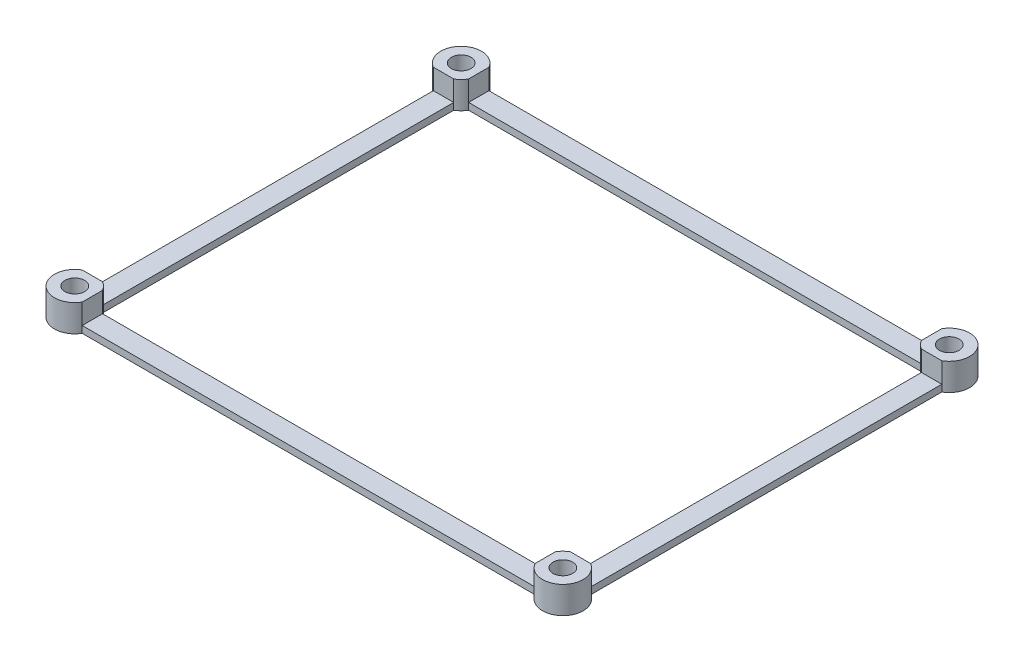
ISO-10303-21;
HEADER;
FILE_DESCRIPTION(('STEP AP214'),'2;1');
FILE_NAME('part.step','',(''),(''),'','','');
FILE_SCHEMA(('AUTOMOTIVE_DESIGN { 1 0 10303 214 1 1 1 1 }'));
ENDSEC;
DATA;
#1=APPLICATION_CONTEXT('core data for automotive mechanical design processes');
#2=APPLICATION_PROTOCOL_DEFINITION('international standard','automotive_design',2000,#1);
#3=PRODUCT_CONTEXT('',#1,'mechanical');
#4=PRODUCT('Part','Part','',(#3));
#5=PRODUCT_RELATED_PRODUCT_CATEGORY('part','',(#4));
#6=PRODUCT_DEFINITION_FORMATION('','',#4);
#7=PRODUCT_DEFINITION_CONTEXT('part definition',#1,'design');
#8=PRODUCT_DEFINITION('design','',#6,#7);
#9=PRODUCT_DEFINITION_SHAPE('','',#8);
#10=(LENGTH_UNIT() NAMED_UNIT(*) SI_UNIT(.MILLI.,.METRE.));
#11=(NAMED_UNIT(*) PLANE_ANGLE_UNIT() SI_UNIT($,.RADIAN.));
#12=(NAMED_UNIT(*) SI_UNIT($,.STERADIAN.) SOLID_ANGLE_UNIT());
#13=UNCERTAINTY_MEASURE_WITH_UNIT(LENGTH_MEASURE(1.E-05),#10,'distance_accuracy_value','');
#14=(GEOMETRIC_REPRESENTATION_CONTEXT(3) GLOBAL_UNCERTAINTY_ASSIGNED_CONTEXT((#13)) GLOBAL_UNIT_ASSIGNED_CONTEXT((#10,
#11,#12)) REPRESENTATION_CONTEXT('',''));
#15=CARTESIAN_POINT('',(0.,0.,0.));
#16=DIRECTION('',(0.,0.,1.));
#17=DIRECTION('',(1.,0.,0.));
#18=AXIS2_PLACEMENT_3D('',#15,#16,#17);
#19=CARTESIAN_POINT('',(36.,4.,-28.5));
#20=DIRECTION('',(0.,1.,0.));
#21=DIRECTION('',(0.,0.,1.));
#22=AXIS2_PLACEMENT_3D('',#19,#20,#21);
#23=PLANE('',#22);
#24=DIRECTION('',(-1.,0.,0.));
#25=VECTOR('',#24,1.);
#26=CARTESIAN_POINT('',(-37.5,4.,-25.9019237886467));
#27=LINE('',#26,#25);
#28=CARTESIAN_POINT('',(-34.5,4.,-25.9019237886467));
#29=VERTEX_POINT('',#28);
#30=CARTESIAN_POINT('',(-37.5,4.,-25.9019237886467));
#31=VERTEX_POINT('',#30);
#32=EDGE_CURVE('E220',#29,#31,#27,.T.);
#33=ORIENTED_EDGE('',*,*,#32,.F.);
#34=CARTESIAN_POINT('',(-36.,4.,-28.5));
#35=DIRECTION('',(0.,-1.,0.));
#36=DIRECTION('',(0.,0.,1.));
#37=AXIS2_PLACEMENT_3D('',#34,#35,#36);
#38=CIRCLE('',#37,3.);
#39=CARTESIAN_POINT('',(-33.4019237886467,4.,-27.));
#40=VERTEX_POINT('',#39);
#41=EDGE_CURVE('E319',#40,#29,#38,.T.);
#42=ORIENTED_EDGE('',*,*,#41,.F.);
#43=DIRECTION('',(0.,0.,1.));
#44=VECTOR('',#43,1.);
#45=CARTESIAN_POINT('',(-33.4019237886467,4.,-27.));
#46=LINE('',#45,#44);
#47=CARTESIAN_POINT('',(-33.4019237886467,4.,-30.));
#48=VERTEX_POINT('',#47);
#49=EDGE_CURVE('E318',#48,#40,#46,.T.);
#50=ORIENTED_EDGE('',*,*,#49,.F.);
#51=CARTESIAN_POINT('',(-36.,4.,-28.5));
#52=DIRECTION('',(0.,1.,0.));
#53=DIRECTION('',(0.,0.,1.));
#54=AXIS2_PLACEMENT_3D('',#51,#52,#53);
#55=CIRCLE('',#54,3.);
#56=EDGE_CURVE('E229',#48,#31,#55,.T.);
#57=ORIENTED_EDGE('',*,*,#56,.T.);
#58=EDGE_LOOP('',(#33,#42,#50,#57));
#59=FACE_BOUND('',#58,.T.);
#60=CARTESIAN_POINT('',(-36.,4.,-28.5));
#61=DIRECTION('',(0.,1.,0.));
#62=DIRECTION('',(0.,0.,1.));
#63=AXIS2_PLACEMENT_3D('',#60,#61,#62);
#64=CIRCLE('',#63,1.45);
#65=CARTESIAN_POINT('',(-36.,4.,-27.05));
#66=VERTEX_POINT('',#65);
#67=EDGE_CURVE('E391',#66,#66,#64,.T.);
#68=ORIENTED_EDGE('',*,*,#67,.F.);
#69=EDGE_LOOP('',(#68));
#70=FACE_BOUND('',#69,.T.);
#71=ADVANCED_FACE('F35',(#59,#70),#23,.T.);
#72=DIRECTION('',(1.,0.,0.));
#73=VECTOR('',#72,1.);
#74=CARTESIAN_POINT('',(-37.5,4.,25.9019237886467));
#75=LINE('',#74,#73);
#76=CARTESIAN_POINT('',(-37.5,4.,25.9019237886467));
#77=VERTEX_POINT('',#76);
#78=CARTESIAN_POINT('',(-34.5,4.,25.9019237886467));
#79=VERTEX_POINT('',#78);
#80=EDGE_CURVE('E200',#77,#79,#75,.T.);
#81=ORIENTED_EDGE('',*,*,#80,.F.);
#82=CARTESIAN_POINT('',(-36.,4.,28.5));
#83=DIRECTION('',(0.,1.,0.));
#84=DIRECTION('',(0.,0.,1.));
#85=AXIS2_PLACEMENT_3D('',#82,#83,#84);
#86=CIRCLE('',#85,3.00000000000001);
#87=CARTESIAN_POINT('',(-33.4019237886467,4.,30.));
#88=VERTEX_POINT('',#87);
#89=EDGE_CURVE('E216',#77,#88,#86,.T.);
#90=ORIENTED_EDGE('',*,*,#89,.T.);
#91=DIRECTION('',(0.,0.,1.));
#92=VECTOR('',#91,1.);
#93=CARTESIAN_POINT('',(-33.4019237886467,4.,27.));
#94=LINE('',#93,#92);
#95=CARTESIAN_POINT('',(-33.4019237886467,4.,27.));
#96=VERTEX_POINT('',#95);
#97=EDGE_CURVE('E434',#96,#88,#94,.T.);
#98=ORIENTED_EDGE('',*,*,#97,.F.);
#99=CARTESIAN_POINT('',(-36.,4.,28.5));
#100=DIRECTION('',(0.,-1.,0.));
#101=DIRECTION('',(0.,0.,1.));
#102=AXIS2_PLACEMENT_3D('',#99,#100,#101);
#103=CIRCLE('',#102,3.00000000000001);
#104=EDGE_CURVE('E219',#79,#96,#103,.T.);
#105=ORIENTED_EDGE('',*,*,#104,.F.);
#106=EDGE_LOOP('',(#81,#90,#98,#105));
#107=FACE_BOUND('',#106,.T.);
#108=CARTESIAN_POINT('',(-36.,4.,28.5));
#109=DIRECTION('',(0.,1.,0.));
#110=DIRECTION('',(0.,0.,1.));
#111=AXIS2_PLACEMENT_3D('',#108,#109,#110);
#112=CIRCLE('',#111,1.45);
#113=CARTESIAN_POINT('',(-36.,4.,29.95));
#114=VERTEX_POINT('',#113);
#115=EDGE_CURVE('E397',#114,#114,#112,.T.);
#116=ORIENTED_EDGE('',*,*,#115,.F.);
#117=EDGE_LOOP('',(#116));
#118=FACE_BOUND('',#117,.T.);
#119=ADVANCED_FACE('F213',(#107,#118),#23,.T.);
#120=DIRECTION('',(-1.,0.,0.));
#121=VECTOR('',#120,1.);
#122=CARTESIAN_POINT('',(34.5,4.,-25.9019237886467));
#123=LINE('',#122,#121);
#124=CARTESIAN_POINT('',(37.5,4.,-25.9019237886467));
#125=VERTEX_POINT('',#124);
#126=CARTESIAN_POINT('',(34.5,4.,-25.9019237886467));
#127=VERTEX_POINT('',#126);
#128=EDGE_CURVE('E421',#125,#127,#123,.T.);
#129=ORIENTED_EDGE('',*,*,#128,.F.);
#130=CARTESIAN_POINT('',(36.,4.,-28.5));
#131=DIRECTION('',(0.,1.,0.));
#132=DIRECTION('',(0.,0.,1.));
#133=AXIS2_PLACEMENT_3D('',#130,#131,#132);
#134=CIRCLE('',#133,3.);
#135=CARTESIAN_POINT('',(33.4019237886467,4.,-30.));
#136=VERTEX_POINT('',#135);
#137=EDGE_CURVE('E235',#125,#136,#134,.T.);
#138=ORIENTED_EDGE('',*,*,#137,.T.);
#139=DIRECTION('',(0.,0.,-1.));
#140=VECTOR('',#139,1.);
#141=CARTESIAN_POINT('',(33.4019237886467,4.,-27.));
#142=LINE('',#141,#140);
#143=CARTESIAN_POINT('',(33.4019237886467,4.,-27.));
#144=VERTEX_POINT('',#143);
#145=EDGE_CURVE('E321',#144,#136,#142,.T.);
#146=ORIENTED_EDGE('',*,*,#145,.F.);
#147=CARTESIAN_POINT('',(36.,4.,-28.5));
#148=DIRECTION('',(0.,-1.,0.));
#149=DIRECTION('',(0.,0.,1.));
#150=AXIS2_PLACEMENT_3D('',#147,#148,#149);
#151=CIRCLE('',#150,3.);
#152=EDGE_CURVE('E338',#127,#144,#151,.T.);
#153=ORIENTED_EDGE('',*,*,#152,.F.);
#154=EDGE_LOOP('',(#129,#138,#146,#153));
#155=FACE_BOUND('',#154,.T.);
#156=CARTESIAN_POINT('',(36.,4.,-28.5));
#157=DIRECTION('',(0.,1.,0.));
#158=DIRECTION('',(0.,0.,1.));
#159=AXIS2_PLACEMENT_3D('',#156,#157,#158);
#160=CIRCLE('',#159,1.45);
#161=CARTESIAN_POINT('',(36.,4.,-27.05));
#162=VERTEX_POINT('',#161);
#163=EDGE_CURVE('E243',#162,#162,#160,.T.);
#164=ORIENTED_EDGE('',*,*,#163,.F.);
#165=EDGE_LOOP('',(#164));
#166=FACE_BOUND('',#165,.T.);
#167=ADVANCED_FACE('F418',(#155,#166),#23,.T.);
#168=CARTESIAN_POINT('',(-33.4019237886467,4.,-30.));
#169=DIRECTION('',(0.,0.,1.));
#170=DIRECTION('',(1.,0.,0.));
#171=AXIS2_PLACEMENT_3D('',#168,#169,#170);
#172=PLANE('',#171);
#173=DIRECTION('',(1.,0.,0.));
#174=VECTOR('',#173,1.);
#175=CARTESIAN_POINT('',(33.4019237886467,1.,-30.));
#176=LINE('',#175,#174);
#177=CARTESIAN_POINT('',(-33.4019237886467,1.,-30.));
#178=VERTEX_POINT('',#177);
#179=CARTESIAN_POINT('',(33.4019237886467,1.,-30.));
#180=VERTEX_POINT('',#179);
#181=EDGE_CURVE('E328',#178,#180,#176,.T.);
#182=ORIENTED_EDGE('',*,*,#181,.T.);
#183=DIRECTION('',(0.,-1.,0.));
#184=VECTOR('',#183,1.);
#185=CARTESIAN_POINT('',(33.4019237886467,4.,-30.));
#186=LINE('',#185,#184);
#187=CARTESIAN_POINT('',(33.4019237886467,0.,-30.));
#188=VERTEX_POINT('',#187);
#189=EDGE_CURVE('E43',#180,#188,#186,.T.);
#190=ORIENTED_EDGE('',*,*,#189,.T.);
#191=DIRECTION('',(-1.,0.,0.));
#192=VECTOR('',#191,1.);
#193=CARTESIAN_POINT('',(-33.4019237886467,0.,-30.));
#194=LINE('',#193,#192);
#195=CARTESIAN_POINT('',(-33.4019237886467,0.,-30.));
#196=VERTEX_POINT('',#195);
#197=EDGE_CURVE('E242',#188,#196,#194,.T.);
#198=ORIENTED_EDGE('',*,*,#197,.T.);
#199=DIRECTION('',(0.,-1.,0.));
#200=VECTOR('',#199,1.);
#201=CARTESIAN_POINT('',(-33.4019237886467,4.,-30.));
#202=LINE('',#201,#200);
#203=EDGE_CURVE('E277',#178,#196,#202,.T.);
#204=ORIENTED_EDGE('',*,*,#203,.F.);
#205=EDGE_LOOP('',(#182,#190,#198,#204));
#206=FACE_BOUND('',#205,.T.);
#207=ADVANCED_FACE('F290',(#206),#172,.F.);
#208=CARTESIAN_POINT('',(-37.5,4.,25.9019237886467));
#209=DIRECTION('',(1.,0.,0.));
#210=DIRECTION('',(0.,0.,-1.));
#211=AXIS2_PLACEMENT_3D('',#208,#209,#210);
#212=PLANE('',#211);
#213=DIRECTION('',(0.,0.,-1.));
#214=VECTOR('',#213,1.);
#215=CARTESIAN_POINT('',(-37.5,1.,-25.9019237886467));
#216=LINE('',#215,#214);
#217=CARTESIAN_POINT('',(-37.5,1.,25.9019237886467));
#218=VERTEX_POINT('',#217);
#219=CARTESIAN_POINT('',(-37.5,1.,-25.9019237886467));
#220=VERTEX_POINT('',#219);
#221=EDGE_CURVE('E302',#218,#220,#216,.T.);
#222=ORIENTED_EDGE('',*,*,#221,.T.);
#223=DIRECTION('',(0.,-1.,0.));
#224=VECTOR('',#223,1.);
#225=CARTESIAN_POINT('',(-37.5,4.,-25.9019237886467));
#226=LINE('',#225,#224);
#227=CARTESIAN_POINT('',(-37.5,0.,-25.9019237886467));
#228=VERTEX_POINT('',#227);
#229=EDGE_CURVE('E207',#220,#228,#226,.T.);
#230=ORIENTED_EDGE('',*,*,#229,.T.);
#231=DIRECTION('',(0.,0.,1.));
#232=VECTOR('',#231,1.);
#233=CARTESIAN_POINT('',(-37.5,0.,25.9019237886467));
#234=LINE('',#233,#232);
#235=CARTESIAN_POINT('',(-37.5,0.,25.9019237886467));
#236=VERTEX_POINT('',#235);
#237=EDGE_CURVE('E249',#228,#236,#234,.T.);
#238=ORIENTED_EDGE('',*,*,#237,.T.);
#239=DIRECTION('',(0.,-1.,0.));
#240=VECTOR('',#239,1.);
#241=CARTESIAN_POINT('',(-37.5,4.,25.9019237886467));
#242=LINE('',#241,#240);
#243=EDGE_CURVE('E208',#218,#236,#242,.T.);
#244=ORIENTED_EDGE('',*,*,#243,.F.);
#245=EDGE_LOOP('',(#222,#230,#238,#244));
#246=FACE_BOUND('',#245,.T.);
#247=ADVANCED_FACE('F301',(#246),#212,.F.);
#248=CARTESIAN_POINT('',(-33.4019237886467,4.,30.));
#249=DIRECTION('',(0.,0.,-1.));
#250=DIRECTION('',(-1.,0.,0.));
#251=AXIS2_PLACEMENT_3D('',#248,#249,#250);
#252=PLANE('',#251);
#253=DIRECTION('',(-1.,0.,0.));
#254=VECTOR('',#253,1.);
#255=CARTESIAN_POINT('',(-33.4019237886467,1.,30.));
#256=LINE('',#255,#254);
#257=CARTESIAN_POINT('',(33.4019237886467,1.,30.));
#258=VERTEX_POINT('',#257);
#259=CARTESIAN_POINT('',(-33.4019237886467,1.,30.));
#260=VERTEX_POINT('',#259);
#261=EDGE_CURVE('E221',#258,#260,#256,.T.);
#262=ORIENTED_EDGE('',*,*,#261,.T.);
#263=DIRECTION('',(0.,-1.,0.));
#264=VECTOR('',#263,1.);
#265=CARTESIAN_POINT('',(-33.4019237886467,4.,30.));
#266=LINE('',#265,#264);
#267=CARTESIAN_POINT('',(-33.4019237886467,0.,30.));
#268=VERTEX_POINT('',#267);
#269=EDGE_CURVE('E273',#260,#268,#266,.T.);
#270=ORIENTED_EDGE('',*,*,#269,.T.);
#271=DIRECTION('',(1.,0.,0.));
#272=VECTOR('',#271,1.);
#273=CARTESIAN_POINT('',(-33.4019237886467,0.,30.));
#274=LINE('',#273,#272);
#275=CARTESIAN_POINT('',(33.4019237886467,0.,30.));
#276=VERTEX_POINT('',#275);
#277=EDGE_CURVE('E254',#268,#276,#274,.T.);
#278=ORIENTED_EDGE('',*,*,#277,.T.);
#279=DIRECTION('',(0.,-1.,0.));
#280=VECTOR('',#279,1.);
#281=CARTESIAN_POINT('',(33.4019237886467,4.,30.));
#282=LINE('',#281,#280);
#283=EDGE_CURVE('E269',#258,#276,#282,.T.);
#284=ORIENTED_EDGE('',*,*,#283,.F.);
#285=EDGE_LOOP('',(#262,#270,#278,#284));
#286=FACE_BOUND('',#285,.T.);
#287=ADVANCED_FACE('F514',(#286),#252,.F.);
#288=CARTESIAN_POINT('',(37.5,4.,25.9019237886467));
#289=DIRECTION('',(-1.,0.,0.));
#290=DIRECTION('',(0.,0.,1.));
#291=AXIS2_PLACEMENT_3D('',#288,#289,#290);
#292=PLANE('',#291);
#293=DIRECTION('',(0.,0.,1.));
#294=VECTOR('',#293,1.);
#295=CARTESIAN_POINT('',(37.5,1.,25.9019237886467));
#296=LINE('',#295,#294);
#297=CARTESIAN_POINT('',(37.5,1.,-25.9019237886467));
#298=VERTEX_POINT('',#297);
#299=CARTESIAN_POINT('',(37.5,1.,25.9019237886467));
#300=VERTEX_POINT('',#299);
#301=EDGE_CURVE('E437',#298,#300,#296,.T.);
#302=ORIENTED_EDGE('',*,*,#301,.T.);
#303=DIRECTION('',(0.,-1.,0.));
#304=VECTOR('',#303,1.);
#305=CARTESIAN_POINT('',(37.5,4.,25.9019237886467));
#306=LINE('',#305,#304);
#307=CARTESIAN_POINT('',(37.5,0.,25.9019237886467));
#308=VERTEX_POINT('',#307);
#309=EDGE_CURVE('E266',#300,#308,#306,.T.);
#310=ORIENTED_EDGE('',*,*,#309,.T.);
#311=DIRECTION('',(0.,0.,-1.));
#312=VECTOR('',#311,1.);
#313=CARTESIAN_POINT('',(37.5,0.,25.9019237886467));
#314=LINE('',#313,#312);
#315=CARTESIAN_POINT('',(37.5,0.,-25.9019237886467));
#316=VERTEX_POINT('',#315);
#317=EDGE_CURVE('E260',#308,#316,#314,.T.);
#318=ORIENTED_EDGE('',*,*,#317,.T.);
#319=DIRECTION('',(0.,-1.,0.));
#320=VECTOR('',#319,1.);
#321=CARTESIAN_POINT('',(37.5,4.,-25.9019237886467));
#322=LINE('',#321,#320);
#323=EDGE_CURVE('E232',#298,#316,#322,.T.);
#324=ORIENTED_EDGE('',*,*,#323,.F.);
#325=EDGE_LOOP('',(#302,#310,#318,#324));
#326=FACE_BOUND('',#325,.T.);
#327=ADVANCED_FACE('F524',(#326),#292,.F.);
#328=CARTESIAN_POINT('',(-34.5,4.,25.9019237886467));
#329=DIRECTION('',(1.,0.,0.));
#330=DIRECTION('',(0.,0.,-1.));
#331=AXIS2_PLACEMENT_3D('',#328,#329,#330);
#332=PLANE('',#331);
#333=DIRECTION('',(0.,-1.,0.));
#334=VECTOR('',#333,1.);
#335=CARTESIAN_POINT('',(-34.5,4.,-25.9019237886467));
#336=LINE('',#335,#334);
#337=CARTESIAN_POINT('',(-34.5,1.,-25.9019237886467));
#338=VERTEX_POINT('',#337);
#339=CARTESIAN_POINT('',(-34.5,0.,-25.9019237886467));
#340=VERTEX_POINT('',#339);
#341=EDGE_CURVE('E388',#338,#340,#336,.T.);
#342=ORIENTED_EDGE('',*,*,#341,.F.);
#343=DIRECTION('',(0.,0.,1.));
#344=VECTOR('',#343,1.);
#345=CARTESIAN_POINT('',(-34.5,1.,-25.9019237886467));
#346=LINE('',#345,#344);
#347=CARTESIAN_POINT('',(-34.5,1.,25.9019237886467));
#348=VERTEX_POINT('',#347);
#349=EDGE_CURVE('E314',#338,#348,#346,.T.);
#350=ORIENTED_EDGE('',*,*,#349,.T.);
#351=DIRECTION('',(0.,-1.,0.));
#352=VECTOR('',#351,1.);
#353=CARTESIAN_POINT('',(-34.5,4.,25.9019237886467));
#354=LINE('',#353,#352);
#355=CARTESIAN_POINT('',(-34.5,0.,25.9019237886467));
#356=VERTEX_POINT('',#355);
#357=EDGE_CURVE('E385',#348,#356,#354,.T.);
#358=ORIENTED_EDGE('',*,*,#357,.T.);
#359=DIRECTION('',(0.,0.,1.));
#360=VECTOR('',#359,1.);
#361=CARTESIAN_POINT('',(-34.5,0.,25.9019237886467));
#362=LINE('',#361,#360);
#363=EDGE_CURVE('E344',#340,#356,#362,.T.);
#364=ORIENTED_EDGE('',*,*,#363,.F.);
#365=EDGE_LOOP('',(#342,#350,#358,#364));
#366=FACE_BOUND('',#365,.T.);
#367=ADVANCED_FACE('F464',(#366),#332,.T.);
#368=CARTESIAN_POINT('',(-33.4019237886467,4.,27.));
#369=DIRECTION('',(0.,0.,-1.));
#370=DIRECTION('',(-1.,0.,0.));
#371=AXIS2_PLACEMENT_3D('',#368,#369,#370);
#372=PLANE('',#371);
#373=DIRECTION('',(0.,-1.,0.));
#374=VECTOR('',#373,1.);
#375=CARTESIAN_POINT('',(-33.4019237886467,4.,27.));
#376=LINE('',#375,#374);
#377=CARTESIAN_POINT('',(-33.4019237886467,1.,27.));
#378=VERTEX_POINT('',#377);
#379=CARTESIAN_POINT('',(-33.4019237886467,0.,27.));
#380=VERTEX_POINT('',#379);
#381=EDGE_CURVE('E381',#378,#380,#376,.T.);
#382=ORIENTED_EDGE('',*,*,#381,.F.);
#383=DIRECTION('',(1.,0.,0.));
#384=VECTOR('',#383,1.);
#385=CARTESIAN_POINT('',(-33.4019237886467,1.,27.));
#386=LINE('',#385,#384);
#387=CARTESIAN_POINT('',(33.4019237886467,1.,27.));
#388=VERTEX_POINT('',#387);
#389=EDGE_CURVE('E453',#378,#388,#386,.T.);
#390=ORIENTED_EDGE('',*,*,#389,.T.);
#391=DIRECTION('',(0.,-1.,0.));
#392=VECTOR('',#391,1.);
#393=CARTESIAN_POINT('',(33.4019237886467,4.,27.));
#394=LINE('',#393,#392);
#395=CARTESIAN_POINT('',(33.4019237886467,0.,27.));
#396=VERTEX_POINT('',#395);
#397=EDGE_CURVE('E377',#388,#396,#394,.T.);
#398=ORIENTED_EDGE('',*,*,#397,.T.);
#399=DIRECTION('',(1.,0.,0.));
#400=VECTOR('',#399,1.);
#401=CARTESIAN_POINT('',(-33.4019237886467,0.,27.));
#402=LINE('',#401,#400);
#403=EDGE_CURVE('E350',#380,#396,#402,.T.);
#404=ORIENTED_EDGE('',*,*,#403,.F.);
#405=EDGE_LOOP('',(#382,#390,#398,#404));
#406=FACE_BOUND('',#405,.T.);
#407=ADVANCED_FACE('F535',(#406),#372,.T.);
#408=CARTESIAN_POINT('',(34.5,4.,25.9019237886467));
#409=DIRECTION('',(-1.,0.,0.));
#410=DIRECTION('',(0.,0.,1.));
#411=AXIS2_PLACEMENT_3D('',#408,#409,#410);
#412=PLANE('',#411);
#413=DIRECTION('',(0.,-1.,0.));
#414=VECTOR('',#413,1.);
#415=CARTESIAN_POINT('',(34.5,4.,25.9019237886467));
#416=LINE('',#415,#414);
#417=CARTESIAN_POINT('',(34.5,1.,25.9019237886467));
#418=VERTEX_POINT('',#417);
#419=CARTESIAN_POINT('',(34.5,0.,25.9019237886467));
#420=VERTEX_POINT('',#419);
#421=EDGE_CURVE('E373',#418,#420,#416,.T.);
#422=ORIENTED_EDGE('',*,*,#421,.F.);
#423=DIRECTION('',(0.,0.,-1.));
#424=VECTOR('',#423,1.);
#425=CARTESIAN_POINT('',(34.5,1.,25.9019237886467));
#426=LINE('',#425,#424);
#427=CARTESIAN_POINT('',(34.5,1.,-25.9019237886467));
#428=VERTEX_POINT('',#427);
#429=EDGE_CURVE('E435',#418,#428,#426,.T.);
#430=ORIENTED_EDGE('',*,*,#429,.T.);
#431=DIRECTION('',(0.,-1.,0.));
#432=VECTOR('',#431,1.);
#433=CARTESIAN_POINT('',(34.5,4.,-25.9019237886467));
#434=LINE('',#433,#432);
#435=CARTESIAN_POINT('',(34.5,0.,-25.9019237886467));
#436=VERTEX_POINT('',#435);
#437=EDGE_CURVE('E369',#428,#436,#434,.T.);
#438=ORIENTED_EDGE('',*,*,#437,.T.);
#439=DIRECTION('',(0.,0.,-1.));
#440=VECTOR('',#439,1.);
#441=CARTESIAN_POINT('',(34.5,0.,25.9019237886467));
#442=LINE('',#441,#440);
#443=EDGE_CURVE('E356',#420,#436,#442,.T.);
#444=ORIENTED_EDGE('',*,*,#443,.F.);
#445=EDGE_LOOP('',(#422,#430,#438,#444));
#446=FACE_BOUND('',#445,.T.);
#447=ADVANCED_FACE('F503',(#446),#412,.T.);
#448=CARTESIAN_POINT('',(-33.4019237886467,4.,-27.));
#449=DIRECTION('',(0.,0.,1.));
#450=DIRECTION('',(1.,0.,0.));
#451=AXIS2_PLACEMENT_3D('',#448,#449,#450);
#452=PLANE('',#451);
#453=DIRECTION('',(0.,-1.,0.));
#454=VECTOR('',#453,1.);
#455=CARTESIAN_POINT('',(33.4019237886467,4.,-27.));
#456=LINE('',#455,#454);
#457=CARTESIAN_POINT('',(33.4019237886467,1.,-27.));
#458=VERTEX_POINT('',#457);
#459=CARTESIAN_POINT('',(33.4019237886467,0.,-27.));
#460=VERTEX_POINT('',#459);
#461=EDGE_CURVE('E365',#458,#460,#456,.T.);
#462=ORIENTED_EDGE('',*,*,#461,.F.);
#463=DIRECTION('',(-1.,0.,0.));
#464=VECTOR('',#463,1.);
#465=CARTESIAN_POINT('',(33.4019237886467,1.,-27.));
#466=LINE('',#465,#464);
#467=CARTESIAN_POINT('',(-33.4019237886467,1.,-27.));
#468=VERTEX_POINT('',#467);
#469=EDGE_CURVE('E323',#458,#468,#466,.T.);
#470=ORIENTED_EDGE('',*,*,#469,.T.);
#471=DIRECTION('',(0.,-1.,0.));
#472=VECTOR('',#471,1.);
#473=CARTESIAN_POINT('',(-33.4019237886467,4.,-27.));
#474=LINE('',#473,#472);
#475=CARTESIAN_POINT('',(-33.4019237886467,0.,-27.));
#476=VERTEX_POINT('',#475);
#477=EDGE_CURVE('E58',#468,#476,#474,.T.);
#478=ORIENTED_EDGE('',*,*,#477,.T.);
#479=DIRECTION('',(-1.,0.,0.));
#480=VECTOR('',#479,1.);
#481=CARTESIAN_POINT('',(-33.4019237886467,0.,-27.));
#482=LINE('',#481,#480);
#483=EDGE_CURVE('E333',#460,#476,#482,.T.);
#484=ORIENTED_EDGE('',*,*,#483,.F.);
#485=EDGE_LOOP('',(#462,#470,#478,#484));
#486=FACE_BOUND('',#485,.T.);
#487=ADVANCED_FACE('F496',(#486),#452,.T.);
#488=DIRECTION('',(0.,0.,-1.));
#489=VECTOR('',#488,1.);
#490=CARTESIAN_POINT('',(33.4019237886467,4.,27.));
#491=LINE('',#490,#489);
#492=CARTESIAN_POINT('',(33.4019237886467,4.,30.));
#493=VERTEX_POINT('',#492);
#494=CARTESIAN_POINT('',(33.4019237886467,4.,27.));
#495=VERTEX_POINT('',#494);
#496=EDGE_CURVE('E448',#493,#495,#491,.T.);
#497=ORIENTED_EDGE('',*,*,#496,.F.);
#498=CARTESIAN_POINT('',(36.,4.,28.5));
#499=DIRECTION('',(0.,1.,0.));
#500=DIRECTION('',(0.,0.,1.));
#501=AXIS2_PLACEMENT_3D('',#498,#499,#500);
#502=CIRCLE('',#501,3.);
#503=CARTESIAN_POINT('',(37.5,4.,25.9019237886467));
#504=VERTEX_POINT('',#503);
#505=EDGE_CURVE('E228',#493,#504,#502,.T.);
#506=ORIENTED_EDGE('',*,*,#505,.T.);
#507=DIRECTION('',(1.,0.,0.));
#508=VECTOR('',#507,1.);
#509=CARTESIAN_POINT('',(34.5,4.,25.9019237886467));
#510=LINE('',#509,#508);
#511=CARTESIAN_POINT('',(34.5,4.,25.9019237886467));
#512=VERTEX_POINT('',#511);
#513=EDGE_CURVE('E330',#512,#504,#510,.T.);
#514=ORIENTED_EDGE('',*,*,#513,.F.);
#515=CARTESIAN_POINT('',(36.,4.,28.5));
#516=DIRECTION('',(0.,-1.,0.));
#517=DIRECTION('',(0.,0.,1.));
#518=AXIS2_PLACEMENT_3D('',#515,#516,#517);
#519=CIRCLE('',#518,3.);
#520=EDGE_CURVE('E335',#495,#512,#519,.T.);
#521=ORIENTED_EDGE('',*,*,#520,.F.);
#522=EDGE_LOOP('',(#497,#506,#514,#521));
#523=FACE_BOUND('',#522,.T.);
#524=CARTESIAN_POINT('',(36.,4.,28.5));
#525=DIRECTION('',(0.,1.,0.));
#526=DIRECTION('',(0.,0.,1.));
#527=AXIS2_PLACEMENT_3D('',#524,#525,#526);
#528=CIRCLE('',#527,1.45);
#529=CARTESIAN_POINT('',(36.,4.,29.95));
#530=VERTEX_POINT('',#529);
#531=EDGE_CURVE('E403',#530,#530,#528,.T.);
#532=ORIENTED_EDGE('',*,*,#531,.F.);
#533=EDGE_LOOP('',(#532));
#534=FACE_BOUND('',#533,.T.);
#535=ADVANCED_FACE('F489',(#523,#534),#23,.T.);
#536=CARTESIAN_POINT('',(36.,0.,-28.5));
#537=DIRECTION('',(0.,1.,0.));
#538=DIRECTION('',(0.,0.,1.));
#539=AXIS2_PLACEMENT_3D('',#536,#537,#538);
#540=PLANE('',#539);
#541=CARTESIAN_POINT('',(-36.,0.,-28.5));
#542=DIRECTION('',(0.,1.,0.));
#543=DIRECTION('',(0.,0.,1.));
#544=AXIS2_PLACEMENT_3D('',#541,#542,#543);
#545=CIRCLE('',#544,1.45);
#546=CARTESIAN_POINT('',(-36.,0.,-27.05));
#547=VERTEX_POINT('',#546);
#548=EDGE_CURVE('E390',#547,#547,#545,.T.);
#549=ORIENTED_EDGE('',*,*,#548,.T.);
#550=EDGE_LOOP('',(#549));
#551=FACE_BOUND('',#550,.T.);
#552=CARTESIAN_POINT('',(-36.,0.,28.5));
#553=DIRECTION('',(0.,1.,0.));
#554=DIRECTION('',(0.,0.,1.));
#555=AXIS2_PLACEMENT_3D('',#552,#553,#554);
#556=CIRCLE('',#555,1.45);
#557=CARTESIAN_POINT('',(-36.,0.,29.95));
#558=VERTEX_POINT('',#557);
#559=EDGE_CURVE('E394',#558,#558,#556,.T.);
#560=ORIENTED_EDGE('',*,*,#559,.T.);
#561=EDGE_LOOP('',(#560));
#562=FACE_BOUND('',#561,.T.);
#563=CARTESIAN_POINT('',(36.,0.,28.5));
#564=DIRECTION('',(0.,1.,0.));
#565=DIRECTION('',(0.,0.,1.));
#566=AXIS2_PLACEMENT_3D('',#563,#564,#565);
#567=CIRCLE('',#566,1.45);
#568=CARTESIAN_POINT('',(36.,0.,29.95));
#569=VERTEX_POINT('',#568);
#570=EDGE_CURVE('E400',#569,#569,#567,.T.);
#571=ORIENTED_EDGE('',*,*,#570,.T.);
#572=EDGE_LOOP('',(#571));
#573=FACE_BOUND('',#572,.T.);
#574=CARTESIAN_POINT('',(36.,0.,-28.5));
#575=DIRECTION('',(0.,1.,0.));
#576=DIRECTION('',(0.,0.,1.));
#577=AXIS2_PLACEMENT_3D('',#574,#575,#576);
#578=CIRCLE('',#577,1.45);
#579=CARTESIAN_POINT('',(36.,0.,-27.05));
#580=VERTEX_POINT('',#579);
#581=EDGE_CURVE('E406',#580,#580,#578,.T.);
#582=ORIENTED_EDGE('',*,*,#581,.T.);
#583=EDGE_LOOP('',(#582));
#584=FACE_BOUND('',#583,.T.);
#585=CARTESIAN_POINT('',(36.,0.,-28.5));
#586=DIRECTION('',(0.,1.,0.));
#587=DIRECTION('',(0.,0.,1.));
#588=AXIS2_PLACEMENT_3D('',#585,#586,#587);
#589=CIRCLE('',#588,3.);
#590=EDGE_CURVE('E239',#316,#188,#589,.T.);
#591=ORIENTED_EDGE('',*,*,#590,.F.);
#592=ORIENTED_EDGE('',*,*,#317,.F.);
#593=CARTESIAN_POINT('',(36.,0.,28.5));
#594=DIRECTION('',(0.,1.,0.));
#595=DIRECTION('',(0.,0.,1.));
#596=AXIS2_PLACEMENT_3D('',#593,#594,#595);
#597=CIRCLE('',#596,3.);
#598=EDGE_CURVE('E257',#276,#308,#597,.T.);
#599=ORIENTED_EDGE('',*,*,#598,.F.);
#600=ORIENTED_EDGE('',*,*,#277,.F.);
#601=CARTESIAN_POINT('',(-36.,0.,28.5));
#602=DIRECTION('',(0.,1.,0.));
#603=DIRECTION('',(0.,0.,1.));
#604=AXIS2_PLACEMENT_3D('',#601,#602,#603);
#605=CIRCLE('',#604,3.00000000000001);
#606=EDGE_CURVE('E252',#236,#268,#605,.T.);
#607=ORIENTED_EDGE('',*,*,#606,.F.);
#608=ORIENTED_EDGE('',*,*,#237,.F.);
#609=CARTESIAN_POINT('',(-36.,0.,-28.5));
#610=DIRECTION('',(0.,1.,0.));
#611=DIRECTION('',(0.,0.,1.));
#612=AXIS2_PLACEMENT_3D('',#609,#610,#611);
#613=CIRCLE('',#612,3.);
#614=EDGE_CURVE('E246',#196,#228,#613,.T.);
#615=ORIENTED_EDGE('',*,*,#614,.F.);
#616=ORIENTED_EDGE('',*,*,#197,.F.);
#617=EDGE_LOOP('',(#591,#592,#599,#600,#607,#608,#615,#616));
#618=FACE_BOUND('',#617,.T.);
#619=CARTESIAN_POINT('',(-36.,0.,-28.5));
#620=DIRECTION('',(0.,-1.,0.));
#621=DIRECTION('',(0.,0.,1.));
#622=AXIS2_PLACEMENT_3D('',#619,#620,#621);
#623=CIRCLE('',#622,3.);
#624=EDGE_CURVE('E341',#476,#340,#623,.T.);
#625=ORIENTED_EDGE('',*,*,#624,.T.);
#626=ORIENTED_EDGE('',*,*,#363,.T.);
#627=CARTESIAN_POINT('',(-36.,0.,28.5));
#628=DIRECTION('',(0.,-1.,0.));
#629=DIRECTION('',(0.,0.,1.));
#630=AXIS2_PLACEMENT_3D('',#627,#628,#629);
#631=CIRCLE('',#630,3.00000000000001);
#632=EDGE_CURVE('E347',#356,#380,#631,.T.);
#633=ORIENTED_EDGE('',*,*,#632,.T.);
#634=ORIENTED_EDGE('',*,*,#403,.T.);
#635=CARTESIAN_POINT('',(36.,0.,28.5));
#636=DIRECTION('',(0.,-1.,0.));
#637=DIRECTION('',(0.,0.,1.));
#638=AXIS2_PLACEMENT_3D('',#635,#636,#637);
#639=CIRCLE('',#638,3.);
#640=EDGE_CURVE('E353',#396,#420,#639,.T.);
#641=ORIENTED_EDGE('',*,*,#640,.T.);
#642=ORIENTED_EDGE('',*,*,#443,.T.);
#643=CARTESIAN_POINT('',(36.,0.,-28.5));
#644=DIRECTION('',(0.,-1.,0.));
#645=DIRECTION('',(0.,0.,1.));
#646=AXIS2_PLACEMENT_3D('',#643,#644,#645);
#647=CIRCLE('',#646,3.);
#648=EDGE_CURVE('E359',#436,#460,#647,.T.);
#649=ORIENTED_EDGE('',*,*,#648,.T.);
#650=ORIENTED_EDGE('',*,*,#483,.T.);
#651=EDGE_LOOP('',(#625,#626,#633,#634,#641,#642,#649,#650));
#652=FACE_BOUND('',#651,.T.);
#653=ADVANCED_FACE('F294',(#551,#562,#573,#584,#618,#652),#540,.F.);
#654=CARTESIAN_POINT('',(36.,4.,-28.5));
#655=DIRECTION('',(0.,-1.,0.));
#656=DIRECTION('',(0.,0.,-1.));
#657=AXIS2_PLACEMENT_3D('',#654,#655,#656);
#658=CYLINDRICAL_SURFACE('',#657,3.);
#659=ORIENTED_EDGE('',*,*,#590,.T.);
#660=ORIENTED_EDGE('',*,*,#189,.F.);
#661=EDGE_CURVE('E12',#136,#180,#186,.T.);
#662=ORIENTED_EDGE('',*,*,#661,.F.);
#663=ORIENTED_EDGE('',*,*,#137,.F.);
#664=EDGE_CURVE('E263',#125,#298,#322,.T.);
#665=ORIENTED_EDGE('',*,*,#664,.T.);
#666=ORIENTED_EDGE('',*,*,#323,.T.);
#667=EDGE_LOOP('',(#659,#660,#662,#663,#665,#666));
#668=FACE_BOUND('',#667,.T.);
#669=ADVANCED_FACE('F37',(#668),#658,.T.);
#670=CARTESIAN_POINT('',(-36.,4.,-28.5));
#671=DIRECTION('',(0.,-1.,0.));
#672=DIRECTION('',(0.,0.,-1.));
#673=AXIS2_PLACEMENT_3D('',#670,#671,#672);
#674=CYLINDRICAL_SURFACE('',#673,3.);
#675=ORIENTED_EDGE('',*,*,#614,.T.);
#676=ORIENTED_EDGE('',*,*,#229,.F.);
#677=EDGE_CURVE('E275',#31,#220,#226,.T.);
#678=ORIENTED_EDGE('',*,*,#677,.F.);
#679=ORIENTED_EDGE('',*,*,#56,.F.);
#680=EDGE_CURVE('E278',#48,#178,#202,.T.);
#681=ORIENTED_EDGE('',*,*,#680,.T.);
#682=ORIENTED_EDGE('',*,*,#203,.T.);
#683=EDGE_LOOP('',(#675,#676,#678,#679,#681,#682));
#684=FACE_BOUND('',#683,.T.);
#685=ADVANCED_FACE('F283',(#684),#674,.T.);
#686=CARTESIAN_POINT('',(-36.,4.,28.5));
#687=DIRECTION('',(0.,-1.,0.));
#688=DIRECTION('',(0.,0.,-1.));
#689=AXIS2_PLACEMENT_3D('',#686,#687,#688);
#690=CYLINDRICAL_SURFACE('',#689,3.00000000000001);
#691=ORIENTED_EDGE('',*,*,#606,.T.);
#692=ORIENTED_EDGE('',*,*,#269,.F.);
#693=EDGE_CURVE('E227',#88,#260,#266,.T.);
#694=ORIENTED_EDGE('',*,*,#693,.F.);
#695=ORIENTED_EDGE('',*,*,#89,.F.);
#696=EDGE_CURVE('E197',#77,#218,#242,.T.);
#697=ORIENTED_EDGE('',*,*,#696,.T.);
#698=ORIENTED_EDGE('',*,*,#243,.T.);
#699=EDGE_LOOP('',(#691,#692,#694,#695,#697,#698));
#700=FACE_BOUND('',#699,.T.);
#701=ADVANCED_FACE('F224',(#700),#690,.T.);
#702=CARTESIAN_POINT('',(36.,4.,28.5));
#703=DIRECTION('',(0.,-1.,0.));
#704=DIRECTION('',(0.,0.,-1.));
#705=AXIS2_PLACEMENT_3D('',#702,#703,#704);
#706=CYLINDRICAL_SURFACE('',#705,3.);
#707=ORIENTED_EDGE('',*,*,#598,.T.);
#708=ORIENTED_EDGE('',*,*,#309,.F.);
#709=EDGE_CURVE('E267',#504,#300,#306,.T.);
#710=ORIENTED_EDGE('',*,*,#709,.F.);
#711=ORIENTED_EDGE('',*,*,#505,.F.);
#712=EDGE_CURVE('E270',#493,#258,#282,.T.);
#713=ORIENTED_EDGE('',*,*,#712,.T.);
#714=ORIENTED_EDGE('',*,*,#283,.T.);
#715=EDGE_LOOP('',(#707,#708,#710,#711,#713,#714));
#716=FACE_BOUND('',#715,.T.);
#717=ADVANCED_FACE('F521',(#716),#706,.T.);
#718=CARTESIAN_POINT('',(36.,4.,-28.5));
#719=DIRECTION('',(0.,-1.,0.));
#720=DIRECTION('',(0.,0.,-1.));
#721=AXIS2_PLACEMENT_3D('',#718,#719,#720);
#722=CYLINDRICAL_SURFACE('',#721,1.45);
#723=ORIENTED_EDGE('',*,*,#163,.T.);
#724=EDGE_LOOP('',(#723));
#725=FACE_BOUND('',#724,.T.);
#726=ORIENTED_EDGE('',*,*,#581,.F.);
#727=EDGE_LOOP('',(#726));
#728=FACE_BOUND('',#727,.T.);
#729=ADVANCED_FACE('F528',(#725,#728),#722,.F.);
#730=CARTESIAN_POINT('',(36.,4.,28.5));
#731=DIRECTION('',(0.,-1.,0.));
#732=DIRECTION('',(0.,0.,-1.));
#733=AXIS2_PLACEMENT_3D('',#730,#731,#732);
#734=CYLINDRICAL_SURFACE('',#733,1.45);
#735=ORIENTED_EDGE('',*,*,#531,.T.);
#736=EDGE_LOOP('',(#735));
#737=FACE_BOUND('',#736,.T.);
#738=ORIENTED_EDGE('',*,*,#570,.F.);
#739=EDGE_LOOP('',(#738));
#740=FACE_BOUND('',#739,.T.);
#741=ADVANCED_FACE('F804',(#737,#740),#734,.F.);
#742=CARTESIAN_POINT('',(-36.,4.,28.5));
#743=DIRECTION('',(0.,-1.,0.));
#744=DIRECTION('',(0.,0.,-1.));
#745=AXIS2_PLACEMENT_3D('',#742,#743,#744);
#746=CYLINDRICAL_SURFACE('',#745,1.45);
#747=ORIENTED_EDGE('',*,*,#115,.T.);
#748=EDGE_LOOP('',(#747));
#749=FACE_BOUND('',#748,.T.);
#750=ORIENTED_EDGE('',*,*,#559,.F.);
#751=EDGE_LOOP('',(#750));
#752=FACE_BOUND('',#751,.T.);
#753=ADVANCED_FACE('F483',(#749,#752),#746,.F.);
#754=CARTESIAN_POINT('',(-36.,4.,-28.5));
#755=DIRECTION('',(0.,-1.,0.));
#756=DIRECTION('',(0.,0.,-1.));
#757=AXIS2_PLACEMENT_3D('',#754,#755,#756);
#758=CYLINDRICAL_SURFACE('',#757,1.45);
#759=ORIENTED_EDGE('',*,*,#67,.T.);
#760=EDGE_LOOP('',(#759));
#761=FACE_BOUND('',#760,.T.);
#762=ORIENTED_EDGE('',*,*,#548,.F.);
#763=EDGE_LOOP('',(#762));
#764=FACE_BOUND('',#763,.T.);
#765=ADVANCED_FACE('F475',(#761,#764),#758,.F.);
#766=CARTESIAN_POINT('',(-36.,4.,-28.5));
#767=DIRECTION('',(0.,-1.,0.));
#768=DIRECTION('',(0.,0.,-1.));
#769=AXIS2_PLACEMENT_3D('',#766,#767,#768);
#770=CYLINDRICAL_SURFACE('',#769,3.);
#771=ORIENTED_EDGE('',*,*,#624,.F.);
#772=ORIENTED_EDGE('',*,*,#477,.F.);
#773=EDGE_CURVE('E50',#40,#468,#474,.T.);
#774=ORIENTED_EDGE('',*,*,#773,.F.);
#775=ORIENTED_EDGE('',*,*,#41,.T.);
#776=EDGE_CURVE('E310',#29,#338,#336,.T.);
#777=ORIENTED_EDGE('',*,*,#776,.T.);
#778=ORIENTED_EDGE('',*,*,#341,.T.);
#779=EDGE_LOOP('',(#771,#772,#774,#775,#777,#778));
#780=FACE_BOUND('',#779,.T.);
#781=ADVANCED_FACE('F473',(#780),#770,.T.);
#782=CARTESIAN_POINT('',(-36.,4.,28.5));
#783=DIRECTION('',(0.,-1.,0.));
#784=DIRECTION('',(0.,0.,-1.));
#785=AXIS2_PLACEMENT_3D('',#782,#783,#784);
#786=CYLINDRICAL_SURFACE('',#785,3.00000000000001);
#787=ORIENTED_EDGE('',*,*,#632,.F.);
#788=ORIENTED_EDGE('',*,*,#357,.F.);
#789=EDGE_CURVE('E386',#79,#348,#354,.T.);
#790=ORIENTED_EDGE('',*,*,#789,.F.);
#791=ORIENTED_EDGE('',*,*,#104,.T.);
#792=EDGE_CURVE('E382',#96,#378,#376,.T.);
#793=ORIENTED_EDGE('',*,*,#792,.T.);
#794=ORIENTED_EDGE('',*,*,#381,.T.);
#795=EDGE_LOOP('',(#787,#788,#790,#791,#793,#794));
#796=FACE_BOUND('',#795,.T.);
#797=ADVANCED_FACE('F469',(#796),#786,.T.);
#798=CARTESIAN_POINT('',(36.,4.,28.5));
#799=DIRECTION('',(0.,-1.,0.));
#800=DIRECTION('',(0.,0.,-1.));
#801=AXIS2_PLACEMENT_3D('',#798,#799,#800);
#802=CYLINDRICAL_SURFACE('',#801,3.);
#803=ORIENTED_EDGE('',*,*,#640,.F.);
#804=ORIENTED_EDGE('',*,*,#397,.F.);
#805=EDGE_CURVE('E378',#495,#388,#394,.T.);
#806=ORIENTED_EDGE('',*,*,#805,.F.);
#807=ORIENTED_EDGE('',*,*,#520,.T.);
#808=EDGE_CURVE('E374',#512,#418,#416,.T.);
#809=ORIENTED_EDGE('',*,*,#808,.T.);
#810=ORIENTED_EDGE('',*,*,#421,.T.);
#811=EDGE_LOOP('',(#803,#804,#806,#807,#809,#810));
#812=FACE_BOUND('',#811,.T.);
#813=ADVANCED_FACE('F481',(#812),#802,.T.);
#814=CARTESIAN_POINT('',(36.,4.,-28.5));
#815=DIRECTION('',(0.,-1.,0.));
#816=DIRECTION('',(0.,0.,-1.));
#817=AXIS2_PLACEMENT_3D('',#814,#815,#816);
#818=CYLINDRICAL_SURFACE('',#817,3.);
#819=ORIENTED_EDGE('',*,*,#648,.F.);
#820=ORIENTED_EDGE('',*,*,#437,.F.);
#821=EDGE_CURVE('E370',#127,#428,#434,.T.);
#822=ORIENTED_EDGE('',*,*,#821,.F.);
#823=ORIENTED_EDGE('',*,*,#152,.T.);
#824=EDGE_CURVE('E366',#144,#458,#456,.T.);
#825=ORIENTED_EDGE('',*,*,#824,.T.);
#826=ORIENTED_EDGE('',*,*,#461,.T.);
#827=EDGE_LOOP('',(#819,#820,#822,#823,#825,#826));
#828=FACE_BOUND('',#827,.T.);
#829=ADVANCED_FACE('F590',(#828),#818,.T.);
#830=CARTESIAN_POINT('',(33.4019237886467,-66.8711750392517,-27.));
#831=DIRECTION('',(1.,0.,0.));
#832=DIRECTION('',(0.,0.,-1.));
#833=AXIS2_PLACEMENT_3D('',#830,#831,#832);
#834=PLANE('',#833);
#835=DIRECTION('',(0.,0.,1.));
#836=VECTOR('',#835,1.);
#837=CARTESIAN_POINT('',(33.4019237886467,1.,-27.));
#838=LINE('',#837,#836);
#839=EDGE_CURVE('E331',#180,#458,#838,.T.);
#840=ORIENTED_EDGE('',*,*,#839,.T.);
#841=ORIENTED_EDGE('',*,*,#824,.F.);
#842=ORIENTED_EDGE('',*,*,#145,.T.);
#843=ORIENTED_EDGE('',*,*,#661,.T.);
#844=EDGE_LOOP('',(#840,#841,#842,#843));
#845=FACE_BOUND('',#844,.T.);
#846=ADVANCED_FACE('F424',(#845),#834,.F.);
#847=CARTESIAN_POINT('',(-33.4019237886467,-66.8711750392517,-27.));
#848=DIRECTION('',(-1.,0.,0.));
#849=DIRECTION('',(0.,0.,1.));
#850=AXIS2_PLACEMENT_3D('',#847,#848,#849);
#851=PLANE('',#850);
#852=DIRECTION('',(0.,0.,-1.));
#853=VECTOR('',#852,1.);
#854=CARTESIAN_POINT('',(-33.4019237886467,1.,-27.));
#855=LINE('',#854,#853);
#856=EDGE_CURVE('E320',#468,#178,#855,.T.);
#857=ORIENTED_EDGE('',*,*,#856,.T.);
#858=ORIENTED_EDGE('',*,*,#680,.F.);
#859=ORIENTED_EDGE('',*,*,#49,.T.);
#860=ORIENTED_EDGE('',*,*,#773,.T.);
#861=EDGE_LOOP('',(#857,#858,#859,#860));
#862=FACE_BOUND('',#861,.T.);
#863=ADVANCED_FACE('F586',(#862),#851,.F.);
#864=CARTESIAN_POINT('',(36.,1.,-28.5));
#865=DIRECTION('',(0.,1.,0.));
#866=DIRECTION('',(0.,0.,1.));
#867=AXIS2_PLACEMENT_3D('',#864,#865,#866);
#868=PLANE('',#867);
#869=ORIENTED_EDGE('',*,*,#839,.F.);
#870=ORIENTED_EDGE('',*,*,#181,.F.);
#871=ORIENTED_EDGE('',*,*,#856,.F.);
#872=ORIENTED_EDGE('',*,*,#469,.F.);
#873=EDGE_LOOP('',(#869,#870,#871,#872));
#874=FACE_BOUND('',#873,.T.);
#875=ADVANCED_FACE('F428',(#874),#868,.T.);
#876=CARTESIAN_POINT('',(34.5,-66.8711750392517,-25.9019237886467));
#877=DIRECTION('',(0.,0.,-1.));
#878=DIRECTION('',(-1.,0.,0.));
#879=AXIS2_PLACEMENT_3D('',#876,#877,#878);
#880=PLANE('',#879);
#881=DIRECTION('',(1.,0.,0.));
#882=VECTOR('',#881,1.);
#883=CARTESIAN_POINT('',(34.5,1.,-25.9019237886467));
#884=LINE('',#883,#882);
#885=EDGE_CURVE('E441',#428,#298,#884,.T.);
#886=ORIENTED_EDGE('',*,*,#885,.T.);
#887=ORIENTED_EDGE('',*,*,#664,.F.);
#888=ORIENTED_EDGE('',*,*,#128,.T.);
#889=ORIENTED_EDGE('',*,*,#821,.T.);
#890=EDGE_LOOP('',(#886,#887,#888,#889));
#891=FACE_BOUND('',#890,.T.);
#892=ADVANCED_FACE('F547',(#891),#880,.F.);
#893=CARTESIAN_POINT('',(34.5,-66.8711750392517,25.9019237886467));
#894=DIRECTION('',(0.,0.,1.));
#895=DIRECTION('',(1.,0.,0.));
#896=AXIS2_PLACEMENT_3D('',#893,#894,#895);
#897=PLANE('',#896);
#898=DIRECTION('',(-1.,0.,0.));
#899=VECTOR('',#898,1.);
#900=CARTESIAN_POINT('',(34.5,1.,25.9019237886467));
#901=LINE('',#900,#899);
#902=EDGE_CURVE('E432',#300,#418,#901,.T.);
#903=ORIENTED_EDGE('',*,*,#902,.T.);
#904=ORIENTED_EDGE('',*,*,#808,.F.);
#905=ORIENTED_EDGE('',*,*,#513,.T.);
#906=ORIENTED_EDGE('',*,*,#709,.T.);
#907=EDGE_LOOP('',(#903,#904,#905,#906));
#908=FACE_BOUND('',#907,.T.);
#909=ADVANCED_FACE('F561',(#908),#897,.F.);
#910=CARTESIAN_POINT('',(36.,1.,-28.5));
#911=DIRECTION('',(0.,1.,0.));
#912=DIRECTION('',(0.,0.,1.));
#913=AXIS2_PLACEMENT_3D('',#910,#911,#912);
#914=PLANE('',#913);
#915=ORIENTED_EDGE('',*,*,#429,.F.);
#916=ORIENTED_EDGE('',*,*,#902,.F.);
#917=ORIENTED_EDGE('',*,*,#301,.F.);
#918=ORIENTED_EDGE('',*,*,#885,.F.);
#919=EDGE_LOOP('',(#915,#916,#917,#918));
#920=FACE_BOUND('',#919,.T.);
#921=ADVANCED_FACE('F550',(#920),#914,.T.);
#922=CARTESIAN_POINT('',(-33.4019237886467,-66.8711750392517,27.));
#923=DIRECTION('',(-1.,0.,0.));
#924=DIRECTION('',(0.,0.,1.));
#925=AXIS2_PLACEMENT_3D('',#922,#923,#924);
#926=PLANE('',#925);
#927=DIRECTION('',(0.,0.,-1.));
#928=VECTOR('',#927,1.);
#929=CARTESIAN_POINT('',(-33.4019237886467,1.,27.));
#930=LINE('',#929,#928);
#931=EDGE_CURVE('E447',#260,#378,#930,.T.);
#932=ORIENTED_EDGE('',*,*,#931,.T.);
#933=ORIENTED_EDGE('',*,*,#792,.F.);
#934=ORIENTED_EDGE('',*,*,#97,.T.);
#935=ORIENTED_EDGE('',*,*,#693,.T.);
#936=EDGE_LOOP('',(#932,#933,#934,#935));
#937=FACE_BOUND('',#936,.T.);
#938=ADVANCED_FACE('F569',(#937),#926,.F.);
#939=CARTESIAN_POINT('',(33.4019237886467,-66.8711750392517,27.));
#940=DIRECTION('',(1.,0.,0.));
#941=DIRECTION('',(0.,0.,-1.));
#942=AXIS2_PLACEMENT_3D('',#939,#940,#941);
#943=PLANE('',#942);
#944=DIRECTION('',(0.,0.,1.));
#945=VECTOR('',#944,1.);
#946=CARTESIAN_POINT('',(33.4019237886467,1.,27.));
#947=LINE('',#946,#945);
#948=EDGE_CURVE('E450',#388,#258,#947,.T.);
#949=ORIENTED_EDGE('',*,*,#948,.T.);
#950=ORIENTED_EDGE('',*,*,#712,.F.);
#951=ORIENTED_EDGE('',*,*,#496,.T.);
#952=ORIENTED_EDGE('',*,*,#805,.T.);
#953=EDGE_LOOP('',(#949,#950,#951,#952));
#954=FACE_BOUND('',#953,.T.);
#955=ADVANCED_FACE('F563',(#954),#943,.F.);
#956=CARTESIAN_POINT('',(36.,1.,-28.5));
#957=DIRECTION('',(0.,1.,0.));
#958=DIRECTION('',(0.,0.,1.));
#959=AXIS2_PLACEMENT_3D('',#956,#957,#958);
#960=PLANE('',#959);
#961=ORIENTED_EDGE('',*,*,#931,.F.);
#962=ORIENTED_EDGE('',*,*,#261,.F.);
#963=ORIENTED_EDGE('',*,*,#948,.F.);
#964=ORIENTED_EDGE('',*,*,#389,.F.);
#965=EDGE_LOOP('',(#961,#962,#963,#964));
#966=FACE_BOUND('',#965,.T.);
#967=ADVANCED_FACE('F567',(#966),#960,.T.);
#968=CARTESIAN_POINT('',(-37.5,-66.8711750392517,-25.9019237886467));
#969=DIRECTION('',(0.,0.,-1.));
#970=DIRECTION('',(-1.,0.,0.));
#971=AXIS2_PLACEMENT_3D('',#968,#969,#970);
#972=PLANE('',#971);
#973=DIRECTION('',(1.,0.,0.));
#974=VECTOR('',#973,1.);
#975=CARTESIAN_POINT('',(-37.5,1.,-25.9019237886467));
#976=LINE('',#975,#974);
#977=EDGE_CURVE('E306',#220,#338,#976,.T.);
#978=ORIENTED_EDGE('',*,*,#977,.T.);
#979=ORIENTED_EDGE('',*,*,#776,.F.);
#980=ORIENTED_EDGE('',*,*,#32,.T.);
#981=ORIENTED_EDGE('',*,*,#677,.T.);
#982=EDGE_LOOP('',(#978,#979,#980,#981));
#983=FACE_BOUND('',#982,.T.);
#984=ADVANCED_FACE('F305',(#983),#972,.F.);
#985=CARTESIAN_POINT('',(-37.5,-66.8711750392517,25.9019237886467));
#986=DIRECTION('',(0.,0.,1.));
#987=DIRECTION('',(1.,0.,0.));
#988=AXIS2_PLACEMENT_3D('',#985,#986,#987);
#989=PLANE('',#988);
#990=DIRECTION('',(-1.,0.,0.));
#991=VECTOR('',#990,1.);
#992=CARTESIAN_POINT('',(-37.5,1.,25.9019237886467));
#993=LINE('',#992,#991);
#994=EDGE_CURVE('E203',#348,#218,#993,.T.);
#995=ORIENTED_EDGE('',*,*,#994,.T.);
#996=ORIENTED_EDGE('',*,*,#696,.F.);
#997=ORIENTED_EDGE('',*,*,#80,.T.);
#998=ORIENTED_EDGE('',*,*,#789,.T.);
#999=EDGE_LOOP('',(#995,#996,#997,#998));
#1000=FACE_BOUND('',#999,.T.);
#1001=ADVANCED_FACE('F199',(#1000),#989,.F.);
#1002=CARTESIAN_POINT('',(36.,1.,-28.5));
#1003=DIRECTION('',(0.,1.,0.));
#1004=DIRECTION('',(0.,0.,1.));
#1005=AXIS2_PLACEMENT_3D('',#1002,#1003,#1004);
#1006=PLANE('',#1005);
#1007=ORIENTED_EDGE('',*,*,#221,.F.);
#1008=ORIENTED_EDGE('',*,*,#994,.F.);
#1009=ORIENTED_EDGE('',*,*,#349,.F.);
#1010=ORIENTED_EDGE('',*,*,#977,.F.);
#1011=EDGE_LOOP('',(#1007,#1008,#1009,#1010));
#1012=FACE_BOUND('',#1011,.T.);
#1013=ADVANCED_FACE('F741',(#1012),#1006,.T.);
#1014=CLOSED_SHELL('',(#71,#119,#167,#207,#247,#287,#327,#367,#407,#447,#487,#535,#653,#669,
#685,#701,#717,#729,#741,#753,#765,#781,#797,#813,#829,#846,#863,#875,#892,#909,#921,#938,#955,
#967,#984,#1001,#1013));
#1015=MANIFOLD_SOLID_BREP('B2',#1014);
#1016=ADVANCED_BREP_SHAPE_REPRESENTATION('',(#18,#1015),#14);
#1017=SHAPE_DEFINITION_REPRESENTATION(#9,#1016);
ENDSEC;
END-ISO-10303-21;
